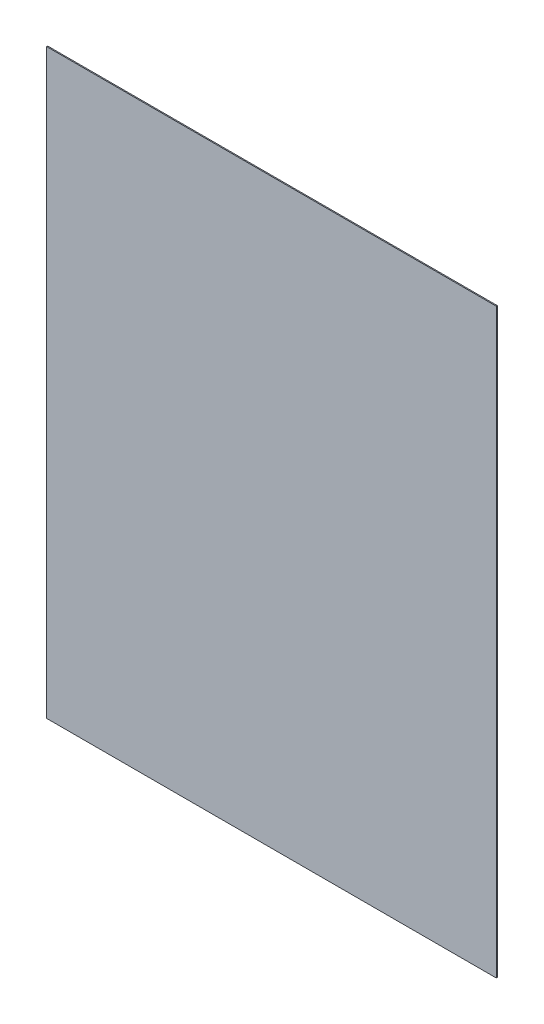
ISO-10303-21;
HEADER;
FILE_DESCRIPTION(('STEP AP214'),'2;1');
FILE_NAME('part.step','',(''),(''),'','','');
FILE_SCHEMA(('AUTOMOTIVE_DESIGN { 1 0 10303 214 1 1 1 1 }'));
ENDSEC;
DATA;
#1=APPLICATION_CONTEXT('core data for automotive mechanical design processes');
#2=APPLICATION_PROTOCOL_DEFINITION('international standard','automotive_design',2000,#1);
#3=PRODUCT_CONTEXT('',#1,'mechanical');
#4=PRODUCT('Part','Part','',(#3));
#5=PRODUCT_RELATED_PRODUCT_CATEGORY('part','',(#4));
#6=PRODUCT_DEFINITION_FORMATION('','',#4);
#7=PRODUCT_DEFINITION_CONTEXT('part definition',#1,'design');
#8=PRODUCT_DEFINITION('design','',#6,#7);
#9=PRODUCT_DEFINITION_SHAPE('','',#8);
#10=(LENGTH_UNIT() NAMED_UNIT(*) SI_UNIT(.MILLI.,.METRE.));
#11=(NAMED_UNIT(*) PLANE_ANGLE_UNIT() SI_UNIT($,.RADIAN.));
#12=(NAMED_UNIT(*) SI_UNIT($,.STERADIAN.) SOLID_ANGLE_UNIT());
#13=UNCERTAINTY_MEASURE_WITH_UNIT(LENGTH_MEASURE(1.E-05),#10,'distance_accuracy_value','');
#14=(GEOMETRIC_REPRESENTATION_CONTEXT(3) GLOBAL_UNCERTAINTY_ASSIGNED_CONTEXT((#13)) GLOBAL_UNIT_ASSIGNED_CONTEXT((#10,
#11,#12)) REPRESENTATION_CONTEXT('',''));
#15=CARTESIAN_POINT('',(0.,0.,0.));
#16=DIRECTION('',(0.,0.,1.));
#17=DIRECTION('',(1.,0.,0.));
#18=AXIS2_PLACEMENT_3D('',#15,#16,#17);
#19=CARTESIAN_POINT('',(0.,0.,0.));
#20=DIRECTION('',(0.,0.,-1.));
#21=DIRECTION('',(-1.,0.,0.));
#22=AXIS2_PLACEMENT_3D('',#19,#20,#21);
#23=PLANE('',#22);
#24=DIRECTION('',(0.,1.,0.));
#25=VECTOR('',#24,1.);
#26=CARTESIAN_POINT('',(-107.95,-139.7,0.));
#27=LINE('',#26,#25);
#28=CARTESIAN_POINT('',(-107.95,-139.7,0.));
#29=VERTEX_POINT('',#28);
#30=CARTESIAN_POINT('',(-107.95,139.7,0.));
#31=VERTEX_POINT('',#30);
#32=EDGE_CURVE('E54',#29,#31,#27,.T.);
#33=ORIENTED_EDGE('',*,*,#32,.T.);
#34=DIRECTION('',(1.,0.,0.));
#35=VECTOR('',#34,1.);
#36=CARTESIAN_POINT('',(-107.95,139.7,0.));
#37=LINE('',#36,#35);
#38=CARTESIAN_POINT('',(107.95,139.7,0.));
#39=VERTEX_POINT('',#38);
#40=EDGE_CURVE('E75',#31,#39,#37,.T.);
#41=ORIENTED_EDGE('',*,*,#40,.T.);
#42=DIRECTION('',(0.,1.,0.));
#43=VECTOR('',#42,1.);
#44=CARTESIAN_POINT('',(107.95,-139.7,0.));
#45=LINE('',#44,#43);
#46=CARTESIAN_POINT('',(107.95,-139.7,0.));
#47=VERTEX_POINT('',#46);
#48=EDGE_CURVE('E57',#39,#47,#45,.F.);
#49=ORIENTED_EDGE('',*,*,#48,.T.);
#50=DIRECTION('',(1.,0.,0.));
#51=VECTOR('',#50,1.);
#52=CARTESIAN_POINT('',(-107.95,-139.7,0.));
#53=LINE('',#52,#51);
#54=EDGE_CURVE('E19',#47,#29,#53,.F.);
#55=ORIENTED_EDGE('',*,*,#54,.T.);
#56=EDGE_LOOP('',(#33,#41,#49,#55));
#57=FACE_BOUND('',#56,.T.);
#58=ADVANCED_FACE('F16',(#57),#23,.T.);
#59=CARTESIAN_POINT('',(-107.95,-139.7,0.5));
#60=DIRECTION('',(0.,1.,0.));
#61=DIRECTION('',(0.,0.,1.));
#62=AXIS2_PLACEMENT_3D('',#59,#60,#61);
#63=PLANE('',#62);
#64=DIRECTION('',(0.,0.,1.));
#65=VECTOR('',#64,1.);
#66=CARTESIAN_POINT('',(107.95,-139.7,0.5));
#67=LINE('',#66,#65);
#68=CARTESIAN_POINT('',(107.95,-139.7,0.5));
#69=VERTEX_POINT('',#68);
#70=EDGE_CURVE('E77',#47,#69,#67,.T.);
#71=ORIENTED_EDGE('',*,*,#70,.T.);
#72=DIRECTION('',(-1.,0.,0.));
#73=VECTOR('',#72,1.);
#74=CARTESIAN_POINT('',(0.,-139.7,0.5));
#75=LINE('',#74,#73);
#76=CARTESIAN_POINT('',(-107.95,-139.7,0.5));
#77=VERTEX_POINT('',#76);
#78=EDGE_CURVE('E72',#69,#77,#75,.T.);
#79=ORIENTED_EDGE('',*,*,#78,.T.);
#80=DIRECTION('',(0.,0.,-1.));
#81=VECTOR('',#80,1.);
#82=CARTESIAN_POINT('',(-107.95,-139.7,0.5));
#83=LINE('',#82,#81);
#84=EDGE_CURVE('E62',#77,#29,#83,.T.);
#85=ORIENTED_EDGE('',*,*,#84,.T.);
#86=ORIENTED_EDGE('',*,*,#54,.F.);
#87=EDGE_LOOP('',(#71,#79,#85,#86));
#88=FACE_BOUND('',#87,.T.);
#89=ADVANCED_FACE('F71',(#88),#63,.F.);
#90=CARTESIAN_POINT('',(-107.95,-139.7,0.5));
#91=DIRECTION('',(1.,0.,0.));
#92=DIRECTION('',(0.,0.,-1.));
#93=AXIS2_PLACEMENT_3D('',#90,#91,#92);
#94=PLANE('',#93);
#95=ORIENTED_EDGE('',*,*,#84,.F.);
#96=DIRECTION('',(0.,1.,0.));
#97=VECTOR('',#96,1.);
#98=CARTESIAN_POINT('',(-107.95,0.,0.5));
#99=LINE('',#98,#97);
#100=CARTESIAN_POINT('',(-107.95,139.7,0.5));
#101=VERTEX_POINT('',#100);
#102=EDGE_CURVE('E82',#77,#101,#99,.T.);
#103=ORIENTED_EDGE('',*,*,#102,.T.);
#104=DIRECTION('',(0.,0.,-1.));
#105=VECTOR('',#104,1.);
#106=CARTESIAN_POINT('',(-107.95,139.7,0.5));
#107=LINE('',#106,#105);
#108=EDGE_CURVE('E68',#101,#31,#107,.T.);
#109=ORIENTED_EDGE('',*,*,#108,.T.);
#110=ORIENTED_EDGE('',*,*,#32,.F.);
#111=EDGE_LOOP('',(#95,#103,#109,#110));
#112=FACE_BOUND('',#111,.T.);
#113=ADVANCED_FACE('F65',(#112),#94,.F.);
#114=CARTESIAN_POINT('',(-107.95,139.7,0.5));
#115=DIRECTION('',(0.,-1.,0.));
#116=DIRECTION('',(0.,0.,-1.));
#117=AXIS2_PLACEMENT_3D('',#114,#115,#116);
#118=PLANE('',#117);
#119=ORIENTED_EDGE('',*,*,#108,.F.);
#120=DIRECTION('',(-1.,0.,0.));
#121=VECTOR('',#120,1.);
#122=CARTESIAN_POINT('',(0.,139.7,0.5));
#123=LINE('',#122,#121);
#124=CARTESIAN_POINT('',(107.95,139.7,0.5));
#125=VERTEX_POINT('',#124);
#126=EDGE_CURVE('E25',#101,#125,#123,.F.);
#127=ORIENTED_EDGE('',*,*,#126,.T.);
#128=DIRECTION('',(0.,0.,1.));
#129=VECTOR('',#128,1.);
#130=CARTESIAN_POINT('',(107.95,139.7,0.5));
#131=LINE('',#130,#129);
#132=EDGE_CURVE('E33',#125,#39,#131,.F.);
#133=ORIENTED_EDGE('',*,*,#132,.T.);
#134=ORIENTED_EDGE('',*,*,#40,.F.);
#135=EDGE_LOOP('',(#119,#127,#133,#134));
#136=FACE_BOUND('',#135,.T.);
#137=ADVANCED_FACE('F87',(#136),#118,.F.);
#138=CARTESIAN_POINT('',(107.95,-139.7,0.5));
#139=DIRECTION('',(-1.,0.,0.));
#140=DIRECTION('',(0.,0.,1.));
#141=AXIS2_PLACEMENT_3D('',#138,#139,#140);
#142=PLANE('',#141);
#143=ORIENTED_EDGE('',*,*,#132,.F.);
#144=DIRECTION('',(0.,1.,0.));
#145=VECTOR('',#144,1.);
#146=CARTESIAN_POINT('',(107.95,0.,0.5));
#147=LINE('',#146,#145);
#148=EDGE_CURVE('E11',#125,#69,#147,.F.);
#149=ORIENTED_EDGE('',*,*,#148,.T.);
#150=ORIENTED_EDGE('',*,*,#70,.F.);
#151=ORIENTED_EDGE('',*,*,#48,.F.);
#152=EDGE_LOOP('',(#143,#149,#150,#151));
#153=FACE_BOUND('',#152,.T.);
#154=ADVANCED_FACE('F90',(#153),#142,.F.);
#155=CARTESIAN_POINT('',(0.,0.,0.5));
#156=DIRECTION('',(0.,0.,-1.));
#157=DIRECTION('',(-1.,0.,0.));
#158=AXIS2_PLACEMENT_3D('',#155,#156,#157);
#159=PLANE('',#158);
#160=ORIENTED_EDGE('',*,*,#126,.F.);
#161=ORIENTED_EDGE('',*,*,#102,.F.);
#162=ORIENTED_EDGE('',*,*,#78,.F.);
#163=ORIENTED_EDGE('',*,*,#148,.F.);
#164=EDGE_LOOP('',(#160,#161,#162,#163));
#165=FACE_BOUND('',#164,.T.);
#166=ADVANCED_FACE('F89',(#165),#159,.F.);
#167=CLOSED_SHELL('',(#58,#89,#113,#137,#154,#166));
#168=MANIFOLD_SOLID_BREP('B1',#167);
#169=ADVANCED_BREP_SHAPE_REPRESENTATION('',(#18,#168),#14);
#170=SHAPE_DEFINITION_REPRESENTATION(#9,#169);
ENDSEC;
END-ISO-10303-21;
